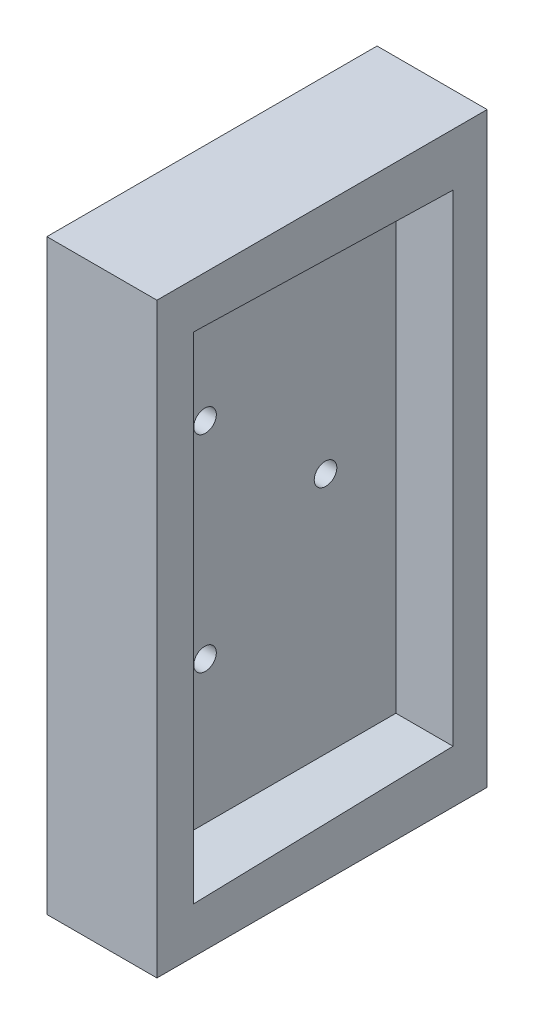
ISO-10303-21;
HEADER;
FILE_DESCRIPTION(('STEP AP214'),'2;1');
FILE_NAME('part.step','',(''),(''),'','','');
FILE_SCHEMA(('AUTOMOTIVE_DESIGN { 1 0 10303 214 1 1 1 1 }'));
ENDSEC;
DATA;
#1=APPLICATION_CONTEXT('core data for automotive mechanical design processes');
#2=APPLICATION_PROTOCOL_DEFINITION('international standard','automotive_design',2000,#1);
#3=PRODUCT_CONTEXT('',#1,'mechanical');
#4=PRODUCT('Part','Part','',(#3));
#5=PRODUCT_RELATED_PRODUCT_CATEGORY('part','',(#4));
#6=PRODUCT_DEFINITION_FORMATION('','',#4);
#7=PRODUCT_DEFINITION_CONTEXT('part definition',#1,'design');
#8=PRODUCT_DEFINITION('design','',#6,#7);
#9=PRODUCT_DEFINITION_SHAPE('','',#8);
#10=(LENGTH_UNIT() NAMED_UNIT(*) SI_UNIT(.MILLI.,.METRE.));
#11=(NAMED_UNIT(*) PLANE_ANGLE_UNIT() SI_UNIT($,.RADIAN.));
#12=(NAMED_UNIT(*) SI_UNIT($,.STERADIAN.) SOLID_ANGLE_UNIT());
#13=UNCERTAINTY_MEASURE_WITH_UNIT(LENGTH_MEASURE(1.E-05),#10,'distance_accuracy_value','');
#14=(GEOMETRIC_REPRESENTATION_CONTEXT(3) GLOBAL_UNCERTAINTY_ASSIGNED_CONTEXT((#13)) GLOBAL_UNIT_ASSIGNED_CONTEXT((#10,
#11,#12)) REPRESENTATION_CONTEXT('',''));
#15=CARTESIAN_POINT('',(0.,0.,0.));
#16=DIRECTION('',(0.,0.,1.));
#17=DIRECTION('',(1.,0.,0.));
#18=AXIS2_PLACEMENT_3D('',#15,#16,#17);
#19=CARTESIAN_POINT('',(-28.5340914700463,55.7530585289766,53.1949353237811));
#20=DIRECTION('',(-1.,0.,0.));
#21=DIRECTION('',(0.,0.,1.));
#22=AXIS2_PLACEMENT_3D('',#19,#20,#21);
#23=PLANE('',#22);
#24=CARTESIAN_POINT('',(-28.5340914700463,109.803058528977,83.1949353237811));
#25=DIRECTION('',(-1.,0.,0.));
#26=DIRECTION('',(0.,0.,1.));
#27=AXIS2_PLACEMENT_3D('',#24,#25,#26);
#28=CIRCLE('',#27,1.5);
#29=CARTESIAN_POINT('',(-28.5340914700463,109.803058528977,84.6949353237811));
#30=VERTEX_POINT('',#29);
#31=EDGE_CURVE('E126',#30,#30,#28,.T.);
#32=ORIENTED_EDGE('',*,*,#31,.F.);
#33=EDGE_LOOP('',(#32));
#34=FACE_BOUND('',#33,.T.);
#35=CARTESIAN_POINT('',(-28.5340914700463,81.7030585289766,83.1949353237811));
#36=DIRECTION('',(-1.,0.,0.));
#37=DIRECTION('',(0.,0.,1.));
#38=AXIS2_PLACEMENT_3D('',#35,#36,#37);
#39=CIRCLE('',#38,1.5);
#40=CARTESIAN_POINT('',(-28.5340914700463,81.7030585289766,84.6949353237811));
#41=VERTEX_POINT('',#40);
#42=EDGE_CURVE('E168',#41,#41,#39,.T.);
#43=ORIENTED_EDGE('',*,*,#42,.F.);
#44=EDGE_LOOP('',(#43));
#45=FACE_BOUND('',#44,.T.);
#46=CARTESIAN_POINT('',(-28.5340914700463,95.7530585289766,67.1949353237811));
#47=DIRECTION('',(-1.,0.,0.));
#48=DIRECTION('',(0.,0.,1.));
#49=AXIS2_PLACEMENT_3D('',#46,#47,#48);
#50=CIRCLE('',#49,1.5);
#51=CARTESIAN_POINT('',(-28.5340914700463,95.7530585289766,68.6949353237811));
#52=VERTEX_POINT('',#51);
#53=EDGE_CURVE('E165',#52,#52,#50,.T.);
#54=ORIENTED_EDGE('',*,*,#53,.F.);
#55=EDGE_LOOP('',(#54));
#56=FACE_BOUND('',#55,.T.);
#57=DIRECTION('',(0.,-1.,0.));
#58=VECTOR('',#57,1.);
#59=CARTESIAN_POINT('',(-28.5340914700463,55.7530585289766,98.1949353237811));
#60=LINE('',#59,#58);
#61=CARTESIAN_POINT('',(-28.5340914700463,135.753058528977,98.1949353237811));
#62=VERTEX_POINT('',#61);
#63=CARTESIAN_POINT('',(-28.5340914700463,55.7530585289766,98.1949353237811));
#64=VERTEX_POINT('',#63);
#65=EDGE_CURVE('E122',#62,#64,#60,.T.);
#66=ORIENTED_EDGE('',*,*,#65,.F.);
#67=DIRECTION('',(0.,0.,1.));
#68=VECTOR('',#67,1.);
#69=CARTESIAN_POINT('',(-28.5340914700463,135.753058528977,53.1949353237811));
#70=LINE('',#69,#68);
#71=CARTESIAN_POINT('',(-28.5340914700463,135.753058528977,53.1949353237811));
#72=VERTEX_POINT('',#71);
#73=EDGE_CURVE('E39',#72,#62,#70,.T.);
#74=ORIENTED_EDGE('',*,*,#73,.F.);
#75=DIRECTION('',(0.,-1.,0.));
#76=VECTOR('',#75,1.);
#77=CARTESIAN_POINT('',(-28.5340914700463,55.7530585289766,53.1949353237811));
#78=LINE('',#77,#76);
#79=CARTESIAN_POINT('',(-28.5340914700463,55.7530585289766,53.1949353237811));
#80=VERTEX_POINT('',#79);
#81=EDGE_CURVE('E114',#72,#80,#78,.T.);
#82=ORIENTED_EDGE('',*,*,#81,.T.);
#83=DIRECTION('',(0.,0.,1.));
#84=VECTOR('',#83,1.);
#85=CARTESIAN_POINT('',(-28.5340914700463,55.7530585289766,53.1949353237811));
#86=LINE('',#85,#84);
#87=EDGE_CURVE('E115',#80,#64,#86,.T.);
#88=ORIENTED_EDGE('',*,*,#87,.T.);
#89=EDGE_LOOP('',(#66,#74,#82,#88));
#90=FACE_BOUND('',#89,.T.);
#91=ADVANCED_FACE('F32',(#34,#45,#56,#90),#23,.T.);
#92=CARTESIAN_POINT('',(-28.5340914700463,135.753058528977,53.1949353237811));
#93=DIRECTION('',(0.,1.,0.));
#94=DIRECTION('',(0.,0.,1.));
#95=AXIS2_PLACEMENT_3D('',#92,#93,#94);
#96=PLANE('',#95);
#97=DIRECTION('',(0.,0.,1.));
#98=VECTOR('',#97,1.);
#99=CARTESIAN_POINT('',(-13.5340914700463,135.753058528977,53.1949353237811));
#100=LINE('',#99,#98);
#101=CARTESIAN_POINT('',(-13.5340914700463,135.753058528977,53.1949353237811));
#102=VERTEX_POINT('',#101);
#103=CARTESIAN_POINT('',(-13.5340914700463,135.753058528977,98.1949353237811));
#104=VERTEX_POINT('',#103);
#105=EDGE_CURVE('E46',#102,#104,#100,.T.);
#106=ORIENTED_EDGE('',*,*,#105,.F.);
#107=DIRECTION('',(-1.,0.,0.));
#108=VECTOR('',#107,1.);
#109=CARTESIAN_POINT('',(-28.5340914700463,135.753058528977,53.1949353237811));
#110=LINE('',#109,#108);
#111=EDGE_CURVE('E107',#102,#72,#110,.T.);
#112=ORIENTED_EDGE('',*,*,#111,.T.);
#113=ORIENTED_EDGE('',*,*,#73,.T.);
#114=DIRECTION('',(-1.,0.,0.));
#115=VECTOR('',#114,1.);
#116=CARTESIAN_POINT('',(-28.5340914700463,135.753058528977,98.1949353237811));
#117=LINE('',#116,#115);
#118=EDGE_CURVE('E109',#104,#62,#117,.T.);
#119=ORIENTED_EDGE('',*,*,#118,.F.);
#120=EDGE_LOOP('',(#106,#112,#113,#119));
#121=FACE_BOUND('',#120,.T.);
#122=ADVANCED_FACE('F105',(#121),#96,.T.);
#123=CARTESIAN_POINT('',(-28.5340914700463,55.7530585289766,53.1949353237811));
#124=DIRECTION('',(0.,-1.,0.));
#125=DIRECTION('',(0.,0.,-1.));
#126=AXIS2_PLACEMENT_3D('',#123,#124,#125);
#127=PLANE('',#126);
#128=DIRECTION('',(0.,0.,-1.));
#129=VECTOR('',#128,1.);
#130=CARTESIAN_POINT('',(-13.5340914700463,55.7530585289766,53.1949353237811));
#131=LINE('',#130,#129);
#132=CARTESIAN_POINT('',(-13.5340914700463,55.7530585289766,98.1949353237811));
#133=VERTEX_POINT('',#132);
#134=CARTESIAN_POINT('',(-13.5340914700463,55.7530585289766,53.1949353237811));
#135=VERTEX_POINT('',#134);
#136=EDGE_CURVE('E96',#133,#135,#131,.T.);
#137=ORIENTED_EDGE('',*,*,#136,.F.);
#138=DIRECTION('',(1.,0.,0.));
#139=VECTOR('',#138,1.);
#140=CARTESIAN_POINT('',(-28.5340914700463,55.7530585289766,98.1949353237811));
#141=LINE('',#140,#139);
#142=EDGE_CURVE('E125',#64,#133,#141,.T.);
#143=ORIENTED_EDGE('',*,*,#142,.F.);
#144=ORIENTED_EDGE('',*,*,#87,.F.);
#145=DIRECTION('',(1.,0.,0.));
#146=VECTOR('',#145,1.);
#147=CARTESIAN_POINT('',(-28.5340914700463,55.7530585289766,53.1949353237811));
#148=LINE('',#147,#146);
#149=EDGE_CURVE('E116',#80,#135,#148,.T.);
#150=ORIENTED_EDGE('',*,*,#149,.T.);
#151=EDGE_LOOP('',(#137,#143,#144,#150));
#152=FACE_BOUND('',#151,.T.);
#153=ADVANCED_FACE('F219',(#152),#127,.T.);
#154=CARTESIAN_POINT('',(-28.5340914700463,55.7530585289766,53.1949353237811));
#155=DIRECTION('',(0.,0.,-1.));
#156=DIRECTION('',(-1.,0.,0.));
#157=AXIS2_PLACEMENT_3D('',#154,#155,#156);
#158=PLANE('',#157);
#159=DIRECTION('',(0.,1.,0.));
#160=VECTOR('',#159,1.);
#161=CARTESIAN_POINT('',(-13.5340914700463,35.7530585289766,53.1949353237811));
#162=LINE('',#161,#160);
#163=EDGE_CURVE('E93',#135,#102,#162,.T.);
#164=ORIENTED_EDGE('',*,*,#163,.F.);
#165=ORIENTED_EDGE('',*,*,#149,.F.);
#166=ORIENTED_EDGE('',*,*,#81,.F.);
#167=ORIENTED_EDGE('',*,*,#111,.F.);
#168=EDGE_LOOP('',(#164,#165,#166,#167));
#169=FACE_BOUND('',#168,.T.);
#170=ADVANCED_FACE('F112',(#169),#158,.T.);
#171=CARTESIAN_POINT('',(-28.5340914700463,55.7530585289766,98.1949353237811));
#172=DIRECTION('',(0.,0.,-1.));
#173=DIRECTION('',(-1.,0.,0.));
#174=AXIS2_PLACEMENT_3D('',#171,#172,#173);
#175=PLANE('',#174);
#176=ORIENTED_EDGE('',*,*,#142,.T.);
#177=DIRECTION('',(0.,1.,0.));
#178=VECTOR('',#177,1.);
#179=CARTESIAN_POINT('',(-13.5340914700463,35.7530585289766,98.1949353237811));
#180=LINE('',#179,#178);
#181=EDGE_CURVE('E101',#133,#104,#180,.T.);
#182=ORIENTED_EDGE('',*,*,#181,.T.);
#183=ORIENTED_EDGE('',*,*,#118,.T.);
#184=ORIENTED_EDGE('',*,*,#65,.T.);
#185=EDGE_LOOP('',(#176,#182,#183,#184));
#186=FACE_BOUND('',#185,.T.);
#187=ADVANCED_FACE('F176',(#186),#175,.F.);
#188=CARTESIAN_POINT('',(-18.5340914700463,95.7530585289766,67.1949353237811));
#189=DIRECTION('',(-1.,0.,0.));
#190=DIRECTION('',(0.,0.,1.));
#191=AXIS2_PLACEMENT_3D('',#188,#189,#190);
#192=CYLINDRICAL_SURFACE('',#191,1.5);
#193=CARTESIAN_POINT('',(-21.5592575092475,95.7530585289766,67.1949353237811));
#194=DIRECTION('',(-0.999657324975557,0.,-0.0261769483078695));
#195=DIRECTION('',(-0.0261769483078695,0.,0.999657324975557));
#196=AXIS2_PLACEMENT_3D('',#193,#194,#195);
#197=ELLIPSE('',#196,1.5005141887363,1.5);
#198=CARTESIAN_POINT('',(-21.5985363916012,95.7530585289766,68.6949353237811));
#199=VERTEX_POINT('',#198);
#200=EDGE_CURVE('E137',#199,#199,#197,.F.);
#201=ORIENTED_EDGE('',*,*,#200,.T.);
#202=EDGE_LOOP('',(#201));
#203=FACE_BOUND('',#202,.T.);
#204=ORIENTED_EDGE('',*,*,#53,.T.);
#205=EDGE_LOOP('',(#204));
#206=FACE_BOUND('',#205,.T.);
#207=ADVANCED_FACE('F227',(#203,#206),#192,.F.);
#208=CARTESIAN_POINT('',(-18.5340914700463,81.7030585289766,83.1949353237811));
#209=DIRECTION('',(-1.,0.,0.));
#210=DIRECTION('',(0.,0.,1.));
#211=AXIS2_PLACEMENT_3D('',#208,#209,#210);
#212=CYLINDRICAL_SURFACE('',#211,1.5);
#213=CARTESIAN_POINT('',(-21.9782322543544,81.7030585289766,83.1949353237811));
#214=DIRECTION('',(-0.999657324975557,0.,-0.0261769483078695));
#215=DIRECTION('',(-0.0261769483078695,0.,0.999657324975557));
#216=AXIS2_PLACEMENT_3D('',#213,#214,#215);
#217=ELLIPSE('',#216,1.5005141887363,1.5);
#218=CARTESIAN_POINT('',(-22.0175111367082,81.7030585289766,84.6949353237811));
#219=VERTEX_POINT('',#218);
#220=EDGE_CURVE('E132',#219,#219,#217,.F.);
#221=ORIENTED_EDGE('',*,*,#220,.T.);
#222=EDGE_LOOP('',(#221));
#223=FACE_BOUND('',#222,.T.);
#224=ORIENTED_EDGE('',*,*,#42,.T.);
#225=EDGE_LOOP('',(#224));
#226=FACE_BOUND('',#225,.T.);
#227=ADVANCED_FACE('F228',(#223,#226),#212,.F.);
#228=CARTESIAN_POINT('',(-18.5340914700463,109.803058528977,83.1949353237811));
#229=DIRECTION('',(-1.,0.,0.));
#230=DIRECTION('',(0.,0.,1.));
#231=AXIS2_PLACEMENT_3D('',#228,#229,#230);
#232=CYLINDRICAL_SURFACE('',#231,1.5);
#233=CARTESIAN_POINT('',(-21.9782322543544,109.803058528977,83.1949353237811));
#234=DIRECTION('',(-0.999657324975557,0.,-0.0261769483078695));
#235=DIRECTION('',(-0.0261769483078695,0.,0.999657324975557));
#236=AXIS2_PLACEMENT_3D('',#233,#234,#235);
#237=ELLIPSE('',#236,1.5005141887363,1.5);
#238=CARTESIAN_POINT('',(-22.0175111367082,109.803058528977,84.6949353237811));
#239=VERTEX_POINT('',#238);
#240=EDGE_CURVE('E130',#239,#239,#237,.F.);
#241=ORIENTED_EDGE('',*,*,#240,.T.);
#242=EDGE_LOOP('',(#241));
#243=FACE_BOUND('',#242,.T.);
#244=ORIENTED_EDGE('',*,*,#31,.T.);
#245=EDGE_LOOP('',(#244));
#246=FACE_BOUND('',#245,.T.);
#247=ADVANCED_FACE('F236',(#243,#246),#232,.F.);
#248=CARTESIAN_POINT('',(38.9659085299537,95.7530585289766,57.8449353237811));
#249=DIRECTION('',(0.,0.,1.));
#250=DIRECTION('',(1.,0.,0.));
#251=AXIS2_PLACEMENT_3D('',#248,#249,#250);
#252=PLANE('',#251);
#253=DIRECTION('',(0.,-1.,0.));
#254=VECTOR('',#253,1.);
#255=CARTESIAN_POINT('',(-13.5340914700463,95.7530585289766,57.8449353237811));
#256=LINE('',#255,#254);
#257=CARTESIAN_POINT('',(-13.5340914700463,128.571553665231,57.8449353237811));
#258=VERTEX_POINT('',#257);
#259=CARTESIAN_POINT('',(-13.5340914700463,62.9345633927218,57.8449353237811));
#260=VERTEX_POINT('',#259);
#261=EDGE_CURVE('E183',#258,#260,#256,.T.);
#262=ORIENTED_EDGE('',*,*,#261,.F.);
#263=DIRECTION('',(-1.,0.,0.));
#264=VECTOR('',#263,1.);
#265=CARTESIAN_POINT('',(38.9659085299537,128.571553665231,57.8449353237811));
#266=LINE('',#265,#264);
#267=CARTESIAN_POINT('',(-21.3144191425756,128.571553665231,57.8449353237811));
#268=VERTEX_POINT('',#267);
#269=EDGE_CURVE('E160',#258,#268,#266,.T.);
#270=ORIENTED_EDGE('',*,*,#269,.T.);
#271=DIRECTION('',(0.,-1.,0.));
#272=VECTOR('',#271,1.);
#273=CARTESIAN_POINT('',(-21.3144191425756,95.7530585289766,57.8449353237811));
#274=LINE('',#273,#272);
#275=CARTESIAN_POINT('',(-21.3144191425756,62.9345633927218,57.8449353237811));
#276=VERTEX_POINT('',#275);
#277=EDGE_CURVE('E154',#268,#276,#274,.T.);
#278=ORIENTED_EDGE('',*,*,#277,.T.);
#279=DIRECTION('',(1.,0.,0.));
#280=VECTOR('',#279,1.);
#281=CARTESIAN_POINT('',(38.9659085299537,62.9345633927218,57.8449353237811));
#282=LINE('',#281,#280);
#283=EDGE_CURVE('E146',#276,#260,#282,.T.);
#284=ORIENTED_EDGE('',*,*,#283,.T.);
#285=EDGE_LOOP('',(#262,#270,#278,#284));
#286=FACE_BOUND('',#285,.T.);
#287=ADVANCED_FACE('F189',(#286),#252,.T.);
#288=CARTESIAN_POINT('',(-22.2400914700462,129.501808528977,93.1949353237811));
#289=DIRECTION('',(-0.999657324975557,0.,-0.0261769483078695));
#290=DIRECTION('',(-0.0261769483078695,0.,0.999657324975558));
#291=AXIS2_PLACEMENT_3D('',#288,#289,#290);
#292=PLANE('',#291);
#293=ORIENTED_EDGE('',*,*,#220,.F.);
#294=EDGE_LOOP('',(#293));
#295=FACE_BOUND('',#294,.T.);
#296=DIRECTION('',(0.,-1.,0.));
#297=VECTOR('',#296,1.);
#298=CARTESIAN_POINT('',(-22.2400914700462,129.501808528977,93.1949353237811));
#299=LINE('',#298,#297);
#300=CARTESIAN_POINT('',(-22.2400914700462,129.501808528977,93.1949353237811));
#301=VERTEX_POINT('',#300);
#302=CARTESIAN_POINT('',(-22.2400914700462,62.0043085289766,93.1949353237811));
#303=VERTEX_POINT('',#302);
#304=EDGE_CURVE('E155',#301,#303,#299,.T.);
#305=ORIENTED_EDGE('',*,*,#304,.T.);
#306=DIRECTION('',(-0.0261678953385402,-0.0262974393748696,0.999311606024806));
#307=VECTOR('',#306,1.);
#308=CARTESIAN_POINT('',(-22.1940993362522,62.0505283466013,91.4385665944036));
#309=LINE('',#308,#307);
#310=EDGE_CURVE('E133',#276,#303,#309,.T.);
#311=ORIENTED_EDGE('',*,*,#310,.F.);
#312=ORIENTED_EDGE('',*,*,#277,.F.);
#313=DIRECTION('',(-0.0261678953385402,0.0262974393748696,0.999311606024806));
#314=VECTOR('',#313,1.);
#315=CARTESIAN_POINT('',(-22.1562682126652,129.417570304975,89.9938542711411));
#316=LINE('',#315,#314);
#317=EDGE_CURVE('E139',#268,#301,#316,.T.);
#318=ORIENTED_EDGE('',*,*,#317,.T.);
#319=EDGE_LOOP('',(#305,#311,#312,#318));
#320=FACE_BOUND('',#319,.T.);
#321=ORIENTED_EDGE('',*,*,#240,.F.);
#322=EDGE_LOOP('',(#321));
#323=FACE_BOUND('',#322,.T.);
#324=ORIENTED_EDGE('',*,*,#200,.F.);
#325=EDGE_LOOP('',(#324));
#326=FACE_BOUND('',#325,.T.);
#327=ADVANCED_FACE('F193',(#295,#320,#323,#326),#292,.F.);
#328=CARTESIAN_POINT('',(-22.2400914700462,62.0043085289766,93.1949353237811));
#329=DIRECTION('',(0.,-0.99965392552087,-0.0263064477023425));
#330=DIRECTION('',(0.,0.0263064477023425,-0.999653925520869));
#331=AXIS2_PLACEMENT_3D('',#328,#329,#330);
#332=PLANE('',#331);
#333=DIRECTION('',(1.,0.,0.));
#334=VECTOR('',#333,1.);
#335=CARTESIAN_POINT('',(-22.2400914700462,62.0043085289766,93.1949353237811));
#336=LINE('',#335,#334);
#337=CARTESIAN_POINT('',(-13.5340914700463,62.0043085289766,93.1949353237811));
#338=VERTEX_POINT('',#337);
#339=EDGE_CURVE('E150',#303,#338,#336,.T.);
#340=ORIENTED_EDGE('',*,*,#339,.T.);
#341=DIRECTION('',(0.,0.0263064477023425,-0.999653925520869));
#342=VECTOR('',#341,1.);
#343=CARTESIAN_POINT('',(-13.5340914700463,62.0043085289766,93.1949353237811));
#344=LINE('',#343,#342);
#345=EDGE_CURVE('E54',#338,#260,#344,.T.);
#346=ORIENTED_EDGE('',*,*,#345,.T.);
#347=ORIENTED_EDGE('',*,*,#283,.F.);
#348=ORIENTED_EDGE('',*,*,#310,.T.);
#349=EDGE_LOOP('',(#340,#346,#347,#348));
#350=FACE_BOUND('',#349,.T.);
#351=ADVANCED_FACE('F187',(#350),#332,.F.);
#352=CARTESIAN_POINT('',(100.171908529954,129.501808528977,93.1949353237811));
#353=DIRECTION('',(0.,0.99965392552087,-0.0263064477023425));
#354=DIRECTION('',(0.,0.0263064477023425,0.999653925520869));
#355=AXIS2_PLACEMENT_3D('',#352,#353,#354);
#356=PLANE('',#355);
#357=ORIENTED_EDGE('',*,*,#269,.F.);
#358=DIRECTION('',(0.,0.0263064477023425,0.999653925520869));
#359=VECTOR('',#358,1.);
#360=CARTESIAN_POINT('',(-13.5340914700463,129.501808528977,93.1949353237811));
#361=LINE('',#360,#359);
#362=CARTESIAN_POINT('',(-13.5340914700463,129.501808528977,93.1949353237811));
#363=VERTEX_POINT('',#362);
#364=EDGE_CURVE('E177',#258,#363,#361,.T.);
#365=ORIENTED_EDGE('',*,*,#364,.T.);
#366=DIRECTION('',(-1.,0.,0.));
#367=VECTOR('',#366,1.);
#368=CARTESIAN_POINT('',(100.171908529954,129.501808528977,93.1949353237811));
#369=LINE('',#368,#367);
#370=EDGE_CURVE('E156',#363,#301,#369,.T.);
#371=ORIENTED_EDGE('',*,*,#370,.T.);
#372=ORIENTED_EDGE('',*,*,#317,.F.);
#373=EDGE_LOOP('',(#357,#365,#371,#372));
#374=FACE_BOUND('',#373,.T.);
#375=ADVANCED_FACE('F200',(#374),#356,.F.);
#376=CARTESIAN_POINT('',(38.9659085299537,95.7530585289766,93.1949353237811));
#377=DIRECTION('',(0.,0.,1.));
#378=DIRECTION('',(1.,0.,0.));
#379=AXIS2_PLACEMENT_3D('',#376,#377,#378);
#380=PLANE('',#379);
#381=ORIENTED_EDGE('',*,*,#370,.F.);
#382=DIRECTION('',(0.,-1.,0.));
#383=VECTOR('',#382,1.);
#384=CARTESIAN_POINT('',(-13.5340914700463,95.7530585289766,93.1949353237811));
#385=LINE('',#384,#383);
#386=EDGE_CURVE('E11',#363,#338,#385,.T.);
#387=ORIENTED_EDGE('',*,*,#386,.T.);
#388=ORIENTED_EDGE('',*,*,#339,.F.);
#389=ORIENTED_EDGE('',*,*,#304,.F.);
#390=EDGE_LOOP('',(#381,#387,#388,#389));
#391=FACE_BOUND('',#390,.T.);
#392=ADVANCED_FACE('F198',(#391),#380,.F.);
#393=CARTESIAN_POINT('',(-13.5340914700463,35.7530585289766,53.1949353237811));
#394=DIRECTION('',(-1.,0.,0.));
#395=DIRECTION('',(0.,0.,1.));
#396=AXIS2_PLACEMENT_3D('',#393,#394,#395);
#397=PLANE('',#396);
#398=ORIENTED_EDGE('',*,*,#136,.T.);
#399=ORIENTED_EDGE('',*,*,#163,.T.);
#400=ORIENTED_EDGE('',*,*,#105,.T.);
#401=ORIENTED_EDGE('',*,*,#181,.F.);
#402=EDGE_LOOP('',(#398,#399,#400,#401));
#403=FACE_BOUND('',#402,.T.);
#404=ORIENTED_EDGE('',*,*,#261,.T.);
#405=ORIENTED_EDGE('',*,*,#345,.F.);
#406=ORIENTED_EDGE('',*,*,#386,.F.);
#407=ORIENTED_EDGE('',*,*,#364,.F.);
#408=EDGE_LOOP('',(#404,#405,#406,#407));
#409=FACE_BOUND('',#408,.T.);
#410=ADVANCED_FACE('F94',(#403,#409),#397,.F.);
#411=CLOSED_SHELL('',(#91,#122,#153,#170,#187,#207,#227,#247,#287,#327,#351,#375,#392,#410));
#412=MANIFOLD_SOLID_BREP('B2',#411);
#413=ADVANCED_BREP_SHAPE_REPRESENTATION('',(#18,#412),#14);
#414=SHAPE_DEFINITION_REPRESENTATION(#9,#413);
ENDSEC;
END-ISO-10303-21;
